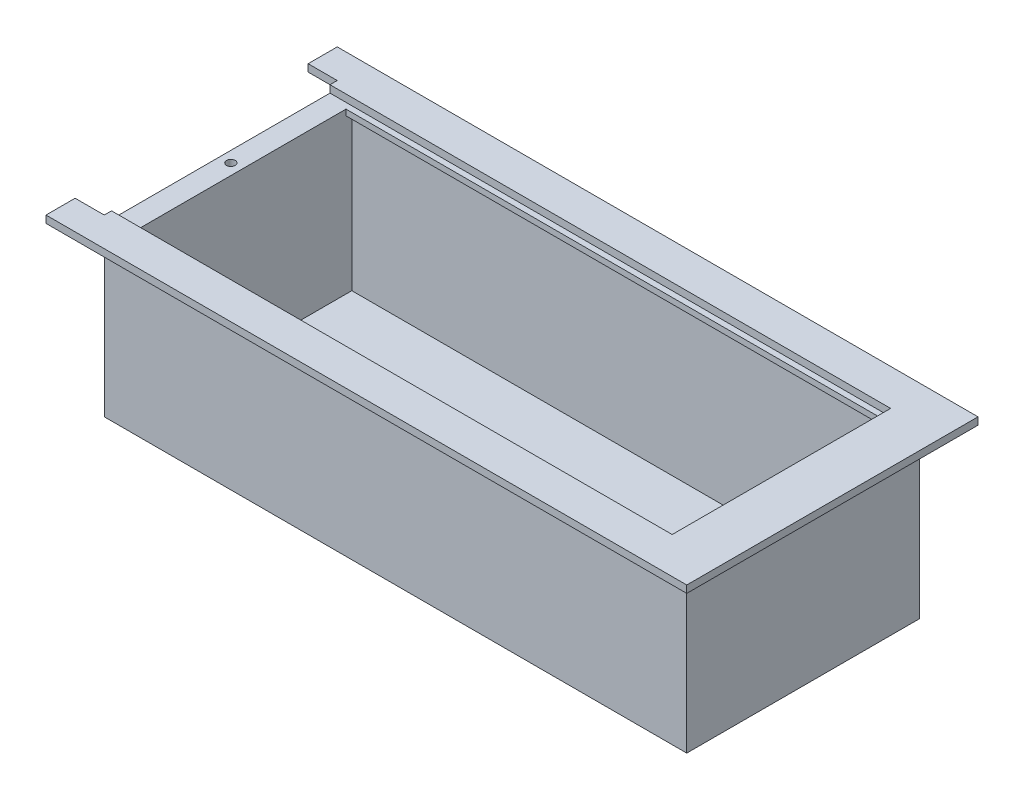
ISO-10303-21;
HEADER;
FILE_DESCRIPTION(('STEP AP214'),'2;1');
FILE_NAME('part.step','',(''),(''),'','','');
FILE_SCHEMA(('AUTOMOTIVE_DESIGN { 1 0 10303 214 1 1 1 1 }'));
ENDSEC;
DATA;
#1=APPLICATION_CONTEXT('core data for automotive mechanical design processes');
#2=APPLICATION_PROTOCOL_DEFINITION('international standard','automotive_design',2000,#1);
#3=PRODUCT_CONTEXT('',#1,'mechanical');
#4=PRODUCT('Part','Part','',(#3));
#5=PRODUCT_RELATED_PRODUCT_CATEGORY('part','',(#4));
#6=PRODUCT_DEFINITION_FORMATION('','',#4);
#7=PRODUCT_DEFINITION_CONTEXT('part definition',#1,'design');
#8=PRODUCT_DEFINITION('design','',#6,#7);
#9=PRODUCT_DEFINITION_SHAPE('','',#8);
#10=(LENGTH_UNIT() NAMED_UNIT(*) SI_UNIT(.MILLI.,.METRE.));
#11=(NAMED_UNIT(*) PLANE_ANGLE_UNIT() SI_UNIT($,.RADIAN.));
#12=(NAMED_UNIT(*) SI_UNIT($,.STERADIAN.) SOLID_ANGLE_UNIT());
#13=UNCERTAINTY_MEASURE_WITH_UNIT(LENGTH_MEASURE(1.E-05),#10,'distance_accuracy_value','');
#14=(GEOMETRIC_REPRESENTATION_CONTEXT(3) GLOBAL_UNCERTAINTY_ASSIGNED_CONTEXT((#13)) GLOBAL_UNIT_ASSIGNED_CONTEXT((#10,
#11,#12)) REPRESENTATION_CONTEXT('',''));
#15=CARTESIAN_POINT('',(0.,0.,0.));
#16=DIRECTION('',(0.,0.,1.));
#17=DIRECTION('',(1.,0.,0.));
#18=AXIS2_PLACEMENT_3D('',#15,#16,#17);
#19=CARTESIAN_POINT('',(7.49999999999995,2.50000000000005,77.5));
#20=DIRECTION('',(-1.,0.,0.));
#21=DIRECTION('',(0.,0.,1.));
#22=AXIS2_PLACEMENT_3D('',#19,#20,#21);
#23=PLANE('',#22);
#24=DIRECTION('',(0.,0.,-1.));
#25=VECTOR('',#24,1.);
#26=CARTESIAN_POINT('',(7.49999999999995,55.5,4.50000000000005));
#27=LINE('',#26,#25);
#28=CARTESIAN_POINT('',(7.49999999999995,55.5,4.50000000000005));
#29=VERTEX_POINT('',#28);
#30=CARTESIAN_POINT('',(7.49999999999995,55.5,2.50000000000005));
#31=VERTEX_POINT('',#30);
#32=EDGE_CURVE('E317',#29,#31,#27,.T.);
#33=ORIENTED_EDGE('',*,*,#32,.F.);
#34=DIRECTION('',(0.,-1.,0.));
#35=VECTOR('',#34,1.);
#36=CARTESIAN_POINT('',(7.49999999999995,57.5,4.50000000000005));
#37=LINE('',#36,#35);
#38=CARTESIAN_POINT('',(7.49999999999995,57.5,4.50000000000005));
#39=VERTEX_POINT('',#38);
#40=EDGE_CURVE('E301',#39,#29,#37,.T.);
#41=ORIENTED_EDGE('',*,*,#40,.F.);
#42=DIRECTION('',(0.,0.,-1.));
#43=VECTOR('',#42,1.);
#44=CARTESIAN_POINT('',(7.49999999999995,57.5,77.5));
#45=LINE('',#44,#43);
#46=CARTESIAN_POINT('',(7.49999999999995,57.5,75.5));
#47=VERTEX_POINT('',#46);
#48=EDGE_CURVE('E397',#47,#39,#45,.T.);
#49=ORIENTED_EDGE('',*,*,#48,.F.);
#50=DIRECTION('',(0.,1.,0.));
#51=VECTOR('',#50,1.);
#52=CARTESIAN_POINT('',(7.49999999999995,57.5,75.5));
#53=LINE('',#52,#51);
#54=CARTESIAN_POINT('',(7.49999999999995,55.5,75.5));
#55=VERTEX_POINT('',#54);
#56=EDGE_CURVE('E320',#55,#47,#53,.T.);
#57=ORIENTED_EDGE('',*,*,#56,.F.);
#58=DIRECTION('',(0.,0.,1.));
#59=VECTOR('',#58,1.);
#60=CARTESIAN_POINT('',(7.49999999999995,55.5,75.5));
#61=LINE('',#60,#59);
#62=CARTESIAN_POINT('',(7.49999999999995,55.5,77.5));
#63=VERTEX_POINT('',#62);
#64=EDGE_CURVE('E328',#55,#63,#61,.T.);
#65=ORIENTED_EDGE('',*,*,#64,.T.);
#66=DIRECTION('',(0.,1.,0.));
#67=VECTOR('',#66,1.);
#68=CARTESIAN_POINT('',(7.49999999999995,2.50000000000005,77.5));
#69=LINE('',#68,#67);
#70=CARTESIAN_POINT('',(7.49999999999995,2.50000000000005,77.5));
#71=VERTEX_POINT('',#70);
#72=EDGE_CURVE('E439',#71,#63,#69,.T.);
#73=ORIENTED_EDGE('',*,*,#72,.F.);
#74=DIRECTION('',(0.,0.,1.));
#75=VECTOR('',#74,1.);
#76=CARTESIAN_POINT('',(7.49999999999995,2.50000000000005,77.5));
#77=LINE('',#76,#75);
#78=CARTESIAN_POINT('',(7.49999999999995,2.50000000000005,2.50000000000005));
#79=VERTEX_POINT('',#78);
#80=EDGE_CURVE('E421',#79,#71,#77,.T.);
#81=ORIENTED_EDGE('',*,*,#80,.F.);
#82=DIRECTION('',(0.,1.,0.));
#83=VECTOR('',#82,1.);
#84=CARTESIAN_POINT('',(7.49999999999995,2.50000000000005,2.50000000000005));
#85=LINE('',#84,#83);
#86=EDGE_CURVE('E442',#79,#31,#85,.T.);
#87=ORIENTED_EDGE('',*,*,#86,.T.);
#88=EDGE_LOOP('',(#33,#41,#49,#57,#65,#73,#81,#87));
#89=FACE_BOUND('',#88,.T.);
#90=ADVANCED_FACE('F33',(#89),#23,.F.);
#91=CARTESIAN_POINT('',(192.5,2.50000000000005,77.5));
#92=DIRECTION('',(1.,0.,0.));
#93=DIRECTION('',(0.,0.,-1.));
#94=AXIS2_PLACEMENT_3D('',#91,#92,#93);
#95=PLANE('',#94);
#96=DIRECTION('',(0.,0.,1.));
#97=VECTOR('',#96,1.);
#98=CARTESIAN_POINT('',(192.5,55.,12.5000000000001));
#99=LINE('',#98,#97);
#100=CARTESIAN_POINT('',(192.5,55.,12.5000000000001));
#101=VERTEX_POINT('',#100);
#102=CARTESIAN_POINT('',(192.5,55.,67.5));
#103=VERTEX_POINT('',#102);
#104=EDGE_CURVE('E284',#101,#103,#99,.T.);
#105=ORIENTED_EDGE('',*,*,#104,.F.);
#106=DIRECTION('',(0.,-1.,0.));
#107=VECTOR('',#106,1.);
#108=CARTESIAN_POINT('',(192.5,57.5,12.5000000000001));
#109=LINE('',#108,#107);
#110=CARTESIAN_POINT('',(192.5,57.5,12.5000000000001));
#111=VERTEX_POINT('',#110);
#112=EDGE_CURVE('E267',#111,#101,#109,.T.);
#113=ORIENTED_EDGE('',*,*,#112,.F.);
#114=DIRECTION('',(0.,0.,-1.));
#115=VECTOR('',#114,1.);
#116=CARTESIAN_POINT('',(192.5,57.5,12.5000000000001));
#117=LINE('',#116,#115);
#118=CARTESIAN_POINT('',(192.5,57.5,67.5));
#119=VERTEX_POINT('',#118);
#120=EDGE_CURVE('E273',#119,#111,#117,.T.);
#121=ORIENTED_EDGE('',*,*,#120,.F.);
#122=DIRECTION('',(0.,1.,0.));
#123=VECTOR('',#122,1.);
#124=CARTESIAN_POINT('',(192.5,57.5,67.5));
#125=LINE('',#124,#123);
#126=EDGE_CURVE('E287',#103,#119,#125,.T.);
#127=ORIENTED_EDGE('',*,*,#126,.F.);
#128=EDGE_LOOP('',(#105,#113,#121,#127));
#129=FACE_BOUND('',#128,.T.);
#130=DIRECTION('',(0.,0.,-1.));
#131=VECTOR('',#130,1.);
#132=CARTESIAN_POINT('',(192.5,55.5,4.50000000000005));
#133=LINE('',#132,#131);
#134=CARTESIAN_POINT('',(192.5,55.5,4.50000000000005));
#135=VERTEX_POINT('',#134);
#136=CARTESIAN_POINT('',(192.5,55.5,2.50000000000005));
#137=VERTEX_POINT('',#136);
#138=EDGE_CURVE('E314',#135,#137,#133,.T.);
#139=ORIENTED_EDGE('',*,*,#138,.T.);
#140=DIRECTION('',(0.,1.,0.));
#141=VECTOR('',#140,1.);
#142=CARTESIAN_POINT('',(192.5,2.50000000000005,2.50000000000003));
#143=LINE('',#142,#141);
#144=CARTESIAN_POINT('',(192.5,2.50000000000005,2.50000000000003));
#145=VERTEX_POINT('',#144);
#146=EDGE_CURVE('E445',#145,#137,#143,.T.);
#147=ORIENTED_EDGE('',*,*,#146,.F.);
#148=DIRECTION('',(0.,0.,-1.));
#149=VECTOR('',#148,1.);
#150=CARTESIAN_POINT('',(192.5,2.50000000000005,77.5));
#151=LINE('',#150,#149);
#152=CARTESIAN_POINT('',(192.5,2.50000000000005,77.5));
#153=VERTEX_POINT('',#152);
#154=EDGE_CURVE('E414',#153,#145,#151,.T.);
#155=ORIENTED_EDGE('',*,*,#154,.F.);
#156=DIRECTION('',(0.,1.,0.));
#157=VECTOR('',#156,1.);
#158=CARTESIAN_POINT('',(192.5,2.50000000000005,77.5));
#159=LINE('',#158,#157);
#160=CARTESIAN_POINT('',(192.5,55.5,77.5));
#161=VERTEX_POINT('',#160);
#162=EDGE_CURVE('E434',#153,#161,#159,.T.);
#163=ORIENTED_EDGE('',*,*,#162,.T.);
#164=DIRECTION('',(0.,0.,1.));
#165=VECTOR('',#164,1.);
#166=CARTESIAN_POINT('',(192.5,55.5,75.5));
#167=LINE('',#166,#165);
#168=CARTESIAN_POINT('',(192.5,55.5,75.5));
#169=VERTEX_POINT('',#168);
#170=EDGE_CURVE('E332',#169,#161,#167,.T.);
#171=ORIENTED_EDGE('',*,*,#170,.F.);
#172=DIRECTION('',(0.,-1.,0.));
#173=VECTOR('',#172,1.);
#174=CARTESIAN_POINT('',(192.5,57.5,75.5));
#175=LINE('',#174,#173);
#176=CARTESIAN_POINT('',(192.5,57.5,75.5));
#177=VERTEX_POINT('',#176);
#178=EDGE_CURVE('E324',#177,#169,#175,.T.);
#179=ORIENTED_EDGE('',*,*,#178,.F.);
#180=DIRECTION('',(0.,0.,1.));
#181=VECTOR('',#180,1.);
#182=CARTESIAN_POINT('',(192.5,57.5,75.5));
#183=LINE('',#182,#181);
#184=CARTESIAN_POINT('',(192.5,57.5,77.5));
#185=VERTEX_POINT('',#184);
#186=EDGE_CURVE('E334',#177,#185,#183,.T.);
#187=ORIENTED_EDGE('',*,*,#186,.T.);
#188=CARTESIAN_POINT('',(192.5,60.0000000000001,77.5));
#189=VERTEX_POINT('',#188);
#190=EDGE_CURVE('E438',#185,#189,#159,.T.);
#191=ORIENTED_EDGE('',*,*,#190,.T.);
#192=DIRECTION('',(0.,0.,-1.));
#193=VECTOR('',#192,1.);
#194=CARTESIAN_POINT('',(192.5,60.0000000000001,77.5));
#195=LINE('',#194,#193);
#196=CARTESIAN_POINT('',(192.5,60.0000000000001,2.50000000000003));
#197=VERTEX_POINT('',#196);
#198=EDGE_CURVE('E411',#189,#197,#195,.T.);
#199=ORIENTED_EDGE('',*,*,#198,.T.);
#200=CARTESIAN_POINT('',(192.5,57.5,2.50000000000005));
#201=VERTEX_POINT('',#200);
#202=EDGE_CURVE('E427',#201,#197,#143,.T.);
#203=ORIENTED_EDGE('',*,*,#202,.F.);
#204=DIRECTION('',(0.,0.,-1.));
#205=VECTOR('',#204,1.);
#206=CARTESIAN_POINT('',(192.5,57.5,4.50000000000005));
#207=LINE('',#206,#205);
#208=CARTESIAN_POINT('',(192.5,57.5,4.50000000000005));
#209=VERTEX_POINT('',#208);
#210=EDGE_CURVE('E310',#209,#201,#207,.T.);
#211=ORIENTED_EDGE('',*,*,#210,.F.);
#212=DIRECTION('',(0.,1.,0.));
#213=VECTOR('',#212,1.);
#214=CARTESIAN_POINT('',(192.5,57.5,4.50000000000005));
#215=LINE('',#214,#213);
#216=EDGE_CURVE('E306',#135,#209,#215,.T.);
#217=ORIENTED_EDGE('',*,*,#216,.F.);
#218=EDGE_LOOP('',(#139,#147,#155,#163,#171,#179,#187,#191,#199,#203,#211,#217));
#219=FACE_BOUND('',#218,.T.);
#220=ADVANCED_FACE('F538',(#129,#219),#95,.F.);
#221=CARTESIAN_POINT('',(192.5,2.50000000000005,2.50000000000003));
#222=DIRECTION('',(0.,0.,-1.));
#223=DIRECTION('',(-1.,0.,0.));
#224=AXIS2_PLACEMENT_3D('',#221,#222,#223);
#225=PLANE('',#224);
#226=DIRECTION('',(1.,0.,0.));
#227=VECTOR('',#226,1.);
#228=CARTESIAN_POINT('',(7.49999999999995,55.5,2.50000000000005));
#229=LINE('',#228,#227);
#230=EDGE_CURVE('E294',#31,#137,#229,.T.);
#231=ORIENTED_EDGE('',*,*,#230,.F.);
#232=ORIENTED_EDGE('',*,*,#86,.F.);
#233=DIRECTION('',(-1.,0.,0.));
#234=VECTOR('',#233,1.);
#235=CARTESIAN_POINT('',(192.5,2.50000000000005,2.50000000000003));
#236=LINE('',#235,#234);
#237=EDGE_CURVE('E417',#145,#79,#236,.T.);
#238=ORIENTED_EDGE('',*,*,#237,.F.);
#239=ORIENTED_EDGE('',*,*,#146,.T.);
#240=EDGE_LOOP('',(#231,#232,#238,#239));
#241=FACE_BOUND('',#240,.T.);
#242=ADVANCED_FACE('F544',(#241),#225,.F.);
#243=DIRECTION('',(-1.,0.,0.));
#244=VECTOR('',#243,1.);
#245=CARTESIAN_POINT('',(7.49999999999995,57.5,2.50000000000004));
#246=LINE('',#245,#244);
#247=CARTESIAN_POINT('',(0.,57.5,2.50000000000004));
#248=VERTEX_POINT('',#247);
#249=EDGE_CURVE('E400',#201,#248,#246,.T.);
#250=ORIENTED_EDGE('',*,*,#249,.F.);
#251=ORIENTED_EDGE('',*,*,#202,.T.);
#252=DIRECTION('',(-1.,0.,0.));
#253=VECTOR('',#252,1.);
#254=CARTESIAN_POINT('',(192.5,60.0000000000001,2.50000000000003));
#255=LINE('',#254,#253);
#256=CARTESIAN_POINT('',(0.,60.0000000000001,2.50000000000004));
#257=VERTEX_POINT('',#256);
#258=EDGE_CURVE('E430',#197,#257,#255,.T.);
#259=ORIENTED_EDGE('',*,*,#258,.T.);
#260=DIRECTION('',(0.,1.,0.));
#261=VECTOR('',#260,1.);
#262=CARTESIAN_POINT('',(0.,57.5,2.50000000000004));
#263=LINE('',#262,#261);
#264=EDGE_CURVE('E407',#248,#257,#263,.T.);
#265=ORIENTED_EDGE('',*,*,#264,.F.);
#266=EDGE_LOOP('',(#250,#251,#259,#265));
#267=FACE_BOUND('',#266,.T.);
#268=ADVANCED_FACE('F551',(#267),#225,.F.);
#269=CARTESIAN_POINT('',(192.5,2.50000000000005,77.5));
#270=DIRECTION('',(0.,0.,1.));
#271=DIRECTION('',(1.,0.,0.));
#272=AXIS2_PLACEMENT_3D('',#269,#270,#271);
#273=PLANE('',#272);
#274=ORIENTED_EDGE('',*,*,#190,.F.);
#275=DIRECTION('',(1.,0.,0.));
#276=VECTOR('',#275,1.);
#277=CARTESIAN_POINT('',(7.49999999999995,57.5,77.5));
#278=LINE('',#277,#276);
#279=CARTESIAN_POINT('',(0.,57.5,77.5));
#280=VERTEX_POINT('',#279);
#281=EDGE_CURVE('E405',#280,#185,#278,.T.);
#282=ORIENTED_EDGE('',*,*,#281,.F.);
#283=DIRECTION('',(0.,1.,0.));
#284=VECTOR('',#283,1.);
#285=CARTESIAN_POINT('',(0.,57.5,77.5));
#286=LINE('',#285,#284);
#287=CARTESIAN_POINT('',(0.,60.0000000000001,77.5));
#288=VERTEX_POINT('',#287);
#289=EDGE_CURVE('E408',#280,#288,#286,.T.);
#290=ORIENTED_EDGE('',*,*,#289,.T.);
#291=DIRECTION('',(1.,0.,0.));
#292=VECTOR('',#291,1.);
#293=CARTESIAN_POINT('',(192.5,60.0000000000001,77.5));
#294=LINE('',#293,#292);
#295=EDGE_CURVE('E418',#288,#189,#294,.T.);
#296=ORIENTED_EDGE('',*,*,#295,.T.);
#297=EDGE_LOOP('',(#274,#282,#290,#296));
#298=FACE_BOUND('',#297,.T.);
#299=ADVANCED_FACE('F533',(#298),#273,.F.);
#300=DIRECTION('',(-1.,0.,0.));
#301=VECTOR('',#300,1.);
#302=CARTESIAN_POINT('',(7.49999999999995,55.5,77.5));
#303=LINE('',#302,#301);
#304=EDGE_CURVE('E319',#161,#63,#303,.T.);
#305=ORIENTED_EDGE('',*,*,#304,.F.);
#306=ORIENTED_EDGE('',*,*,#162,.F.);
#307=DIRECTION('',(1.,0.,0.));
#308=VECTOR('',#307,1.);
#309=CARTESIAN_POINT('',(192.5,2.50000000000005,77.5));
#310=LINE('',#309,#308);
#311=EDGE_CURVE('E424',#71,#153,#310,.T.);
#312=ORIENTED_EDGE('',*,*,#311,.F.);
#313=ORIENTED_EDGE('',*,*,#72,.T.);
#314=EDGE_LOOP('',(#305,#306,#312,#313));
#315=FACE_BOUND('',#314,.T.);
#316=ADVANCED_FACE('F526',(#315),#273,.F.);
#317=CARTESIAN_POINT('',(200.,0.,80.));
#318=DIRECTION('',(-1.,0.,0.));
#319=DIRECTION('',(0.,0.,1.));
#320=AXIS2_PLACEMENT_3D('',#317,#318,#319);
#321=PLANE('',#320);
#322=DIRECTION('',(0.,0.,-1.));
#323=VECTOR('',#322,1.);
#324=CARTESIAN_POINT('',(200.,57.5,90.));
#325=LINE('',#324,#323);
#326=CARTESIAN_POINT('',(200.,57.5,80.));
#327=VERTEX_POINT('',#326);
#328=CARTESIAN_POINT('',(200.,57.5,0.));
#329=VERTEX_POINT('',#328);
#330=EDGE_CURVE('E11',#327,#329,#325,.T.);
#331=ORIENTED_EDGE('',*,*,#330,.F.);
#332=DIRECTION('',(0.,1.,0.));
#333=VECTOR('',#332,1.);
#334=CARTESIAN_POINT('',(200.,0.,80.));
#335=LINE('',#334,#333);
#336=CARTESIAN_POINT('',(200.,0.,80.));
#337=VERTEX_POINT('',#336);
#338=EDGE_CURVE('E454',#337,#327,#335,.T.);
#339=ORIENTED_EDGE('',*,*,#338,.F.);
#340=DIRECTION('',(0.,0.,-1.));
#341=VECTOR('',#340,1.);
#342=CARTESIAN_POINT('',(200.,0.,80.));
#343=LINE('',#342,#341);
#344=CARTESIAN_POINT('',(200.,0.,0.));
#345=VERTEX_POINT('',#344);
#346=EDGE_CURVE('E467',#337,#345,#343,.T.);
#347=ORIENTED_EDGE('',*,*,#346,.T.);
#348=DIRECTION('',(0.,1.,0.));
#349=VECTOR('',#348,1.);
#350=CARTESIAN_POINT('',(200.,0.,0.));
#351=LINE('',#350,#349);
#352=EDGE_CURVE('E462',#345,#329,#351,.T.);
#353=ORIENTED_EDGE('',*,*,#352,.T.);
#354=EDGE_LOOP('',(#331,#339,#347,#353));
#355=FACE_BOUND('',#354,.T.);
#356=ADVANCED_FACE('F524',(#355),#321,.F.);
#357=CARTESIAN_POINT('',(0.,0.,80.));
#358=DIRECTION('',(0.,0.,-1.));
#359=DIRECTION('',(-1.,0.,0.));
#360=AXIS2_PLACEMENT_3D('',#357,#358,#359);
#361=PLANE('',#360);
#362=DIRECTION('',(1.,0.,0.));
#363=VECTOR('',#362,1.);
#364=CARTESIAN_POINT('',(-10.,57.5,80.));
#365=LINE('',#364,#363);
#366=CARTESIAN_POINT('',(0.,57.5,80.));
#367=VERTEX_POINT('',#366);
#368=EDGE_CURVE('E42',#367,#327,#365,.T.);
#369=ORIENTED_EDGE('',*,*,#368,.F.);
#370=DIRECTION('',(0.,-1.,0.));
#371=VECTOR('',#370,1.);
#372=CARTESIAN_POINT('',(0.,0.,80.));
#373=LINE('',#372,#371);
#374=CARTESIAN_POINT('',(0.,0.,80.));
#375=VERTEX_POINT('',#374);
#376=EDGE_CURVE('E452',#367,#375,#373,.T.);
#377=ORIENTED_EDGE('',*,*,#376,.T.);
#378=DIRECTION('',(1.,0.,0.));
#379=VECTOR('',#378,1.);
#380=CARTESIAN_POINT('',(0.,0.,80.));
#381=LINE('',#380,#379);
#382=EDGE_CURVE('E451',#375,#337,#381,.T.);
#383=ORIENTED_EDGE('',*,*,#382,.T.);
#384=ORIENTED_EDGE('',*,*,#338,.T.);
#385=EDGE_LOOP('',(#369,#377,#383,#384));
#386=FACE_BOUND('',#385,.T.);
#387=ADVANCED_FACE('F483',(#386),#361,.F.);
#388=CARTESIAN_POINT('',(0.,0.,80.));
#389=DIRECTION('',(1.,0.,0.));
#390=DIRECTION('',(0.,0.,-1.));
#391=AXIS2_PLACEMENT_3D('',#388,#389,#390);
#392=PLANE('',#391);
#393=DIRECTION('',(0.,0.,-1.));
#394=VECTOR('',#393,1.);
#395=CARTESIAN_POINT('',(0.,60.0000000000001,80.));
#396=LINE('',#395,#394);
#397=CARTESIAN_POINT('',(0.,60.0000000000001,80.));
#398=VERTEX_POINT('',#397);
#399=EDGE_CURVE('E465',#398,#288,#396,.T.);
#400=ORIENTED_EDGE('',*,*,#399,.T.);
#401=ORIENTED_EDGE('',*,*,#289,.F.);
#402=DIRECTION('',(0.,0.,1.));
#403=VECTOR('',#402,1.);
#404=CARTESIAN_POINT('',(0.,57.5,77.5));
#405=LINE('',#404,#403);
#406=EDGE_CURVE('E403',#248,#280,#405,.T.);
#407=ORIENTED_EDGE('',*,*,#406,.F.);
#408=ORIENTED_EDGE('',*,*,#264,.T.);
#409=CARTESIAN_POINT('',(0.,60.0000000000001,0.));
#410=VERTEX_POINT('',#409);
#411=EDGE_CURVE('E457',#257,#410,#396,.T.);
#412=ORIENTED_EDGE('',*,*,#411,.T.);
#413=DIRECTION('',(0.,-1.,0.));
#414=VECTOR('',#413,1.);
#415=CARTESIAN_POINT('',(0.,0.,0.));
#416=LINE('',#415,#414);
#417=CARTESIAN_POINT('',(0.,57.5,0.));
#418=VERTEX_POINT('',#417);
#419=EDGE_CURVE('E458',#410,#418,#416,.T.);
#420=ORIENTED_EDGE('',*,*,#419,.T.);
#421=CARTESIAN_POINT('',(0.,0.,0.));
#422=VERTEX_POINT('',#421);
#423=EDGE_CURVE('E437',#418,#422,#416,.T.);
#424=ORIENTED_EDGE('',*,*,#423,.T.);
#425=DIRECTION('',(0.,0.,-1.));
#426=VECTOR('',#425,1.);
#427=CARTESIAN_POINT('',(0.,0.,80.));
#428=LINE('',#427,#426);
#429=EDGE_CURVE('E37',#375,#422,#428,.T.);
#430=ORIENTED_EDGE('',*,*,#429,.F.);
#431=ORIENTED_EDGE('',*,*,#376,.F.);
#432=EDGE_CURVE('E448',#398,#367,#373,.T.);
#433=ORIENTED_EDGE('',*,*,#432,.F.);
#434=EDGE_LOOP('',(#400,#401,#407,#408,#412,#420,#424,#430,#431,#433));
#435=FACE_BOUND('',#434,.T.);
#436=ADVANCED_FACE('F35',(#435),#392,.F.);
#437=CARTESIAN_POINT('',(0.,0.,80.));
#438=DIRECTION('',(0.,1.,0.));
#439=DIRECTION('',(0.,0.,1.));
#440=AXIS2_PLACEMENT_3D('',#437,#438,#439);
#441=PLANE('',#440);
#442=DIRECTION('',(-1.,0.,0.));
#443=VECTOR('',#442,1.);
#444=CARTESIAN_POINT('',(42.5,0.,47.5));
#445=LINE('',#444,#443);
#446=CARTESIAN_POINT('',(42.5,0.,47.5));
#447=VERTEX_POINT('',#446);
#448=CARTESIAN_POINT('',(17.5,0.,47.5));
#449=VERTEX_POINT('',#448);
#450=EDGE_CURVE('E565',#447,#449,#445,.T.);
#451=ORIENTED_EDGE('',*,*,#450,.F.);
#452=DIRECTION('',(0.,0.,1.));
#453=VECTOR('',#452,1.);
#454=CARTESIAN_POINT('',(42.5,0.,47.5));
#455=LINE('',#454,#453);
#456=CARTESIAN_POINT('',(42.5,0.,32.5));
#457=VERTEX_POINT('',#456);
#458=EDGE_CURVE('E268',#457,#447,#455,.T.);
#459=ORIENTED_EDGE('',*,*,#458,.F.);
#460=DIRECTION('',(1.,0.,0.));
#461=VECTOR('',#460,1.);
#462=CARTESIAN_POINT('',(42.5,0.,32.5));
#463=LINE('',#462,#461);
#464=CARTESIAN_POINT('',(17.5,0.,32.5));
#465=VERTEX_POINT('',#464);
#466=EDGE_CURVE('E265',#465,#457,#463,.T.);
#467=ORIENTED_EDGE('',*,*,#466,.F.);
#468=DIRECTION('',(0.,0.,-1.));
#469=VECTOR('',#468,1.);
#470=CARTESIAN_POINT('',(17.5,0.,47.5));
#471=LINE('',#470,#469);
#472=EDGE_CURVE('E243',#449,#465,#471,.T.);
#473=ORIENTED_EDGE('',*,*,#472,.F.);
#474=EDGE_LOOP('',(#451,#459,#467,#473));
#475=FACE_BOUND('',#474,.T.);
#476=DIRECTION('',(1.,0.,0.));
#477=VECTOR('',#476,1.);
#478=CARTESIAN_POINT('',(0.,0.,0.));
#479=LINE('',#478,#477);
#480=EDGE_CURVE('E460',#422,#345,#479,.T.);
#481=ORIENTED_EDGE('',*,*,#480,.T.);
#482=ORIENTED_EDGE('',*,*,#346,.F.);
#483=ORIENTED_EDGE('',*,*,#382,.F.);
#484=ORIENTED_EDGE('',*,*,#429,.T.);
#485=EDGE_LOOP('',(#481,#482,#483,#484));
#486=FACE_BOUND('',#485,.T.);
#487=ADVANCED_FACE('F523',(#475,#486),#441,.F.);
#488=CARTESIAN_POINT('',(0.,60.0000000000001,80.));
#489=DIRECTION('',(0.,-1.,0.));
#490=DIRECTION('',(0.,0.,-1.));
#491=AXIS2_PLACEMENT_3D('',#488,#489,#490);
#492=PLANE('',#491);
#493=ORIENTED_EDGE('',*,*,#295,.F.);
#494=ORIENTED_EDGE('',*,*,#399,.F.);
#495=DIRECTION('',(-1.,0.,0.));
#496=VECTOR('',#495,1.);
#497=CARTESIAN_POINT('',(-10.,60.0000000000001,80.));
#498=LINE('',#497,#496);
#499=CARTESIAN_POINT('',(-10.,60.0000000000001,80.));
#500=VERTEX_POINT('',#499);
#501=EDGE_CURVE('E360',#398,#500,#498,.T.);
#502=ORIENTED_EDGE('',*,*,#501,.T.);
#503=DIRECTION('',(0.,0.,-1.));
#504=VECTOR('',#503,1.);
#505=CARTESIAN_POINT('',(-10.,60.0000000000001,90.));
#506=LINE('',#505,#504);
#507=CARTESIAN_POINT('',(-10.,60.0000000000001,90.));
#508=VERTEX_POINT('',#507);
#509=EDGE_CURVE('E364',#508,#500,#506,.T.);
#510=ORIENTED_EDGE('',*,*,#509,.F.);
#511=DIRECTION('',(-1.,0.,0.));
#512=VECTOR('',#511,1.);
#513=CARTESIAN_POINT('',(-10.,60.0000000000001,90.));
#514=LINE('',#513,#512);
#515=CARTESIAN_POINT('',(210.,60.0000000000001,90.));
#516=VERTEX_POINT('',#515);
#517=EDGE_CURVE('E362',#516,#508,#514,.T.);
#518=ORIENTED_EDGE('',*,*,#517,.F.);
#519=DIRECTION('',(0.,0.,1.));
#520=VECTOR('',#519,1.);
#521=CARTESIAN_POINT('',(210.,60.0000000000001,90.));
#522=LINE('',#521,#520);
#523=CARTESIAN_POINT('',(210.,60.0000000000001,-10.));
#524=VERTEX_POINT('',#523);
#525=EDGE_CURVE('E352',#524,#516,#522,.T.);
#526=ORIENTED_EDGE('',*,*,#525,.F.);
#527=DIRECTION('',(1.,0.,0.));
#528=VECTOR('',#527,1.);
#529=CARTESIAN_POINT('',(200.,60.0000000000001,-10.));
#530=LINE('',#529,#528);
#531=CARTESIAN_POINT('',(-10.,60.0000000000001,-10.));
#532=VERTEX_POINT('',#531);
#533=EDGE_CURVE('E382',#532,#524,#530,.T.);
#534=ORIENTED_EDGE('',*,*,#533,.F.);
#535=DIRECTION('',(0.,0.,1.));
#536=VECTOR('',#535,1.);
#537=CARTESIAN_POINT('',(-10.,60.0000000000001,-10.));
#538=LINE('',#537,#536);
#539=CARTESIAN_POINT('',(-10.,60.0000000000001,0.));
#540=VERTEX_POINT('',#539);
#541=EDGE_CURVE('E384',#532,#540,#538,.T.);
#542=ORIENTED_EDGE('',*,*,#541,.T.);
#543=DIRECTION('',(1.,0.,0.));
#544=VECTOR('',#543,1.);
#545=CARTESIAN_POINT('',(200.,60.0000000000001,0.));
#546=LINE('',#545,#544);
#547=EDGE_CURVE('E380',#540,#410,#546,.T.);
#548=ORIENTED_EDGE('',*,*,#547,.T.);
#549=ORIENTED_EDGE('',*,*,#411,.F.);
#550=ORIENTED_EDGE('',*,*,#258,.F.);
#551=ORIENTED_EDGE('',*,*,#198,.F.);
#552=EDGE_LOOP('',(#493,#494,#502,#510,#518,#526,#534,#542,#548,#549,#550,#551));
#553=FACE_BOUND('',#552,.T.);
#554=ADVANCED_FACE('F492',(#553),#492,.F.);
#555=CARTESIAN_POINT('',(0.,0.,0.));
#556=DIRECTION('',(0.,0.,-1.));
#557=DIRECTION('',(-1.,0.,0.));
#558=AXIS2_PLACEMENT_3D('',#555,#556,#557);
#559=PLANE('',#558);
#560=DIRECTION('',(-1.,0.,0.));
#561=VECTOR('',#560,1.);
#562=CARTESIAN_POINT('',(200.,57.5,0.));
#563=LINE('',#562,#561);
#564=EDGE_CURVE('E385',#329,#418,#563,.T.);
#565=ORIENTED_EDGE('',*,*,#564,.F.);
#566=ORIENTED_EDGE('',*,*,#352,.F.);
#567=ORIENTED_EDGE('',*,*,#480,.F.);
#568=ORIENTED_EDGE('',*,*,#423,.F.);
#569=EDGE_LOOP('',(#565,#566,#567,#568));
#570=FACE_BOUND('',#569,.T.);
#571=ADVANCED_FACE('F522',(#570),#559,.T.);
#572=CARTESIAN_POINT('',(0.,2.50000000000005,0.));
#573=DIRECTION('',(0.,1.,0.));
#574=DIRECTION('',(0.,0.,1.));
#575=AXIS2_PLACEMENT_3D('',#572,#573,#574);
#576=PLANE('',#575);
#577=DIRECTION('',(0.,0.,-1.));
#578=VECTOR('',#577,1.);
#579=CARTESIAN_POINT('',(42.5,2.50000000000005,47.5));
#580=LINE('',#579,#578);
#581=CARTESIAN_POINT('',(42.5,2.50000000000005,47.5));
#582=VERTEX_POINT('',#581);
#583=CARTESIAN_POINT('',(42.5,2.50000000000005,32.5));
#584=VERTEX_POINT('',#583);
#585=EDGE_CURVE('E58',#582,#584,#580,.T.);
#586=ORIENTED_EDGE('',*,*,#585,.F.);
#587=DIRECTION('',(1.,0.,0.));
#588=VECTOR('',#587,1.);
#589=CARTESIAN_POINT('',(42.5,2.50000000000005,47.5));
#590=LINE('',#589,#588);
#591=CARTESIAN_POINT('',(17.5,2.50000000000005,47.5));
#592=VERTEX_POINT('',#591);
#593=EDGE_CURVE('E256',#592,#582,#590,.T.);
#594=ORIENTED_EDGE('',*,*,#593,.F.);
#595=DIRECTION('',(0.,0.,1.));
#596=VECTOR('',#595,1.);
#597=CARTESIAN_POINT('',(17.5,2.50000000000005,47.5));
#598=LINE('',#597,#596);
#599=CARTESIAN_POINT('',(17.5,2.50000000000005,32.5));
#600=VERTEX_POINT('',#599);
#601=EDGE_CURVE('E240',#600,#592,#598,.T.);
#602=ORIENTED_EDGE('',*,*,#601,.F.);
#603=DIRECTION('',(-1.,0.,0.));
#604=VECTOR('',#603,1.);
#605=CARTESIAN_POINT('',(42.5,2.50000000000005,32.5));
#606=LINE('',#605,#604);
#607=EDGE_CURVE('E249',#584,#600,#606,.T.);
#608=ORIENTED_EDGE('',*,*,#607,.F.);
#609=EDGE_LOOP('',(#586,#594,#602,#608));
#610=FACE_BOUND('',#609,.T.);
#611=ORIENTED_EDGE('',*,*,#154,.T.);
#612=ORIENTED_EDGE('',*,*,#237,.T.);
#613=ORIENTED_EDGE('',*,*,#80,.T.);
#614=ORIENTED_EDGE('',*,*,#311,.T.);
#615=EDGE_LOOP('',(#611,#612,#613,#614));
#616=FACE_BOUND('',#615,.T.);
#617=ADVANCED_FACE('F253',(#610,#616),#576,.T.);
#618=CARTESIAN_POINT('',(0.,57.5,0.));
#619=DIRECTION('',(0.,1.,0.));
#620=DIRECTION('',(0.,0.,1.));
#621=AXIS2_PLACEMENT_3D('',#618,#619,#620);
#622=PLANE('',#621);
#623=CARTESIAN_POINT('',(3.74999999999998,57.5,40.2652980210047));
#624=DIRECTION('',(0.,1.,0.));
#625=DIRECTION('',(0.,0.,1.));
#626=AXIS2_PLACEMENT_3D('',#623,#624,#625);
#627=CIRCLE('',#626,1.5);
#628=CARTESIAN_POINT('',(3.74999999999998,57.5,41.7652980210047));
#629=VERTEX_POINT('',#628);
#630=EDGE_CURVE('E337',#629,#629,#627,.T.);
#631=ORIENTED_EDGE('',*,*,#630,.F.);
#632=EDGE_LOOP('',(#631));
#633=FACE_BOUND('',#632,.T.);
#634=ORIENTED_EDGE('',*,*,#281,.T.);
#635=ORIENTED_EDGE('',*,*,#186,.F.);
#636=DIRECTION('',(1.,0.,0.));
#637=VECTOR('',#636,1.);
#638=CARTESIAN_POINT('',(7.49999999999995,57.5,75.5));
#639=LINE('',#638,#637);
#640=EDGE_CURVE('E322',#47,#177,#639,.T.);
#641=ORIENTED_EDGE('',*,*,#640,.F.);
#642=ORIENTED_EDGE('',*,*,#48,.T.);
#643=DIRECTION('',(-1.,0.,0.));
#644=VECTOR('',#643,1.);
#645=CARTESIAN_POINT('',(7.49999999999995,57.5,4.50000000000005));
#646=LINE('',#645,#644);
#647=EDGE_CURVE('E308',#209,#39,#646,.T.);
#648=ORIENTED_EDGE('',*,*,#647,.F.);
#649=ORIENTED_EDGE('',*,*,#210,.T.);
#650=ORIENTED_EDGE('',*,*,#249,.T.);
#651=ORIENTED_EDGE('',*,*,#406,.T.);
#652=EDGE_LOOP('',(#634,#635,#641,#642,#648,#649,#650,#651));
#653=FACE_BOUND('',#652,.T.);
#654=ADVANCED_FACE('F645',(#633,#653),#622,.T.);
#655=CARTESIAN_POINT('',(200.,57.5,-10.));
#656=DIRECTION('',(0.,1.,0.));
#657=DIRECTION('',(0.,0.,1.));
#658=AXIS2_PLACEMENT_3D('',#655,#656,#657);
#659=PLANE('',#658);
#660=ORIENTED_EDGE('',*,*,#564,.T.);
#661=CARTESIAN_POINT('',(-10.,57.5,0.));
#662=VERTEX_POINT('',#661);
#663=EDGE_CURVE('E376',#418,#662,#563,.T.);
#664=ORIENTED_EDGE('',*,*,#663,.T.);
#665=DIRECTION('',(0.,0.,1.));
#666=VECTOR('',#665,1.);
#667=CARTESIAN_POINT('',(-10.,57.5,-10.));
#668=LINE('',#667,#666);
#669=CARTESIAN_POINT('',(-10.,57.5,-10.));
#670=VERTEX_POINT('',#669);
#671=EDGE_CURVE('E394',#670,#662,#668,.T.);
#672=ORIENTED_EDGE('',*,*,#671,.F.);
#673=DIRECTION('',(-1.,0.,0.));
#674=VECTOR('',#673,1.);
#675=CARTESIAN_POINT('',(200.,57.5,-10.));
#676=LINE('',#675,#674);
#677=CARTESIAN_POINT('',(210.,57.5,-10.));
#678=VERTEX_POINT('',#677);
#679=EDGE_CURVE('E377',#678,#670,#676,.T.);
#680=ORIENTED_EDGE('',*,*,#679,.F.);
#681=DIRECTION('',(0.,0.,-1.));
#682=VECTOR('',#681,1.);
#683=CARTESIAN_POINT('',(210.,57.5,90.));
#684=LINE('',#683,#682);
#685=CARTESIAN_POINT('',(210.,57.5,90.));
#686=VERTEX_POINT('',#685);
#687=EDGE_CURVE('E346',#686,#678,#684,.T.);
#688=ORIENTED_EDGE('',*,*,#687,.F.);
#689=DIRECTION('',(1.,0.,0.));
#690=VECTOR('',#689,1.);
#691=CARTESIAN_POINT('',(-10.,57.5,90.));
#692=LINE('',#691,#690);
#693=CARTESIAN_POINT('',(-10.,57.5,90.));
#694=VERTEX_POINT('',#693);
#695=EDGE_CURVE('E359',#694,#686,#692,.T.);
#696=ORIENTED_EDGE('',*,*,#695,.F.);
#697=DIRECTION('',(0.,0.,-1.));
#698=VECTOR('',#697,1.);
#699=CARTESIAN_POINT('',(-10.,57.5,90.));
#700=LINE('',#699,#698);
#701=CARTESIAN_POINT('',(-10.,57.5,80.));
#702=VERTEX_POINT('',#701);
#703=EDGE_CURVE('E373',#694,#702,#700,.T.);
#704=ORIENTED_EDGE('',*,*,#703,.T.);
#705=EDGE_CURVE('E367',#702,#367,#365,.T.);
#706=ORIENTED_EDGE('',*,*,#705,.T.);
#707=ORIENTED_EDGE('',*,*,#368,.T.);
#708=ORIENTED_EDGE('',*,*,#330,.T.);
#709=EDGE_LOOP('',(#660,#664,#672,#680,#688,#696,#704,#706,#707,#708));
#710=FACE_BOUND('',#709,.T.);
#711=ADVANCED_FACE('F479',(#710),#659,.F.);
#712=CARTESIAN_POINT('',(-10.,60.0000000000001,-10.));
#713=DIRECTION('',(1.,0.,0.));
#714=DIRECTION('',(0.,0.,-1.));
#715=AXIS2_PLACEMENT_3D('',#712,#713,#714);
#716=PLANE('',#715);
#717=DIRECTION('',(0.,1.,0.));
#718=VECTOR('',#717,1.);
#719=CARTESIAN_POINT('',(-10.,60.0000000000001,0.));
#720=LINE('',#719,#718);
#721=EDGE_CURVE('E388',#662,#540,#720,.T.);
#722=ORIENTED_EDGE('',*,*,#721,.T.);
#723=ORIENTED_EDGE('',*,*,#541,.F.);
#724=DIRECTION('',(0.,1.,0.));
#725=VECTOR('',#724,1.);
#726=CARTESIAN_POINT('',(-10.,60.0000000000001,-10.));
#727=LINE('',#726,#725);
#728=EDGE_CURVE('E379',#670,#532,#727,.T.);
#729=ORIENTED_EDGE('',*,*,#728,.F.);
#730=ORIENTED_EDGE('',*,*,#671,.T.);
#731=EDGE_LOOP('',(#722,#723,#729,#730));
#732=FACE_BOUND('',#731,.T.);
#733=ADVANCED_FACE('F638',(#732),#716,.F.);
#734=CARTESIAN_POINT('',(0.,0.,-10.));
#735=DIRECTION('',(0.,0.,-1.));
#736=DIRECTION('',(-1.,0.,0.));
#737=AXIS2_PLACEMENT_3D('',#734,#735,#736);
#738=PLANE('',#737);
#739=ORIENTED_EDGE('',*,*,#533,.T.);
#740=DIRECTION('',(0.,1.,0.));
#741=VECTOR('',#740,1.);
#742=CARTESIAN_POINT('',(210.,60.0000000000001,-10.));
#743=LINE('',#742,#741);
#744=EDGE_CURVE('E349',#678,#524,#743,.T.);
#745=ORIENTED_EDGE('',*,*,#744,.F.);
#746=ORIENTED_EDGE('',*,*,#679,.T.);
#747=ORIENTED_EDGE('',*,*,#728,.T.);
#748=EDGE_LOOP('',(#739,#745,#746,#747));
#749=FACE_BOUND('',#748,.T.);
#750=ADVANCED_FACE('F507',(#749),#738,.T.);
#751=CARTESIAN_POINT('',(0.,0.,0.));
#752=DIRECTION('',(0.,0.,-1.));
#753=DIRECTION('',(-1.,0.,0.));
#754=AXIS2_PLACEMENT_3D('',#751,#752,#753);
#755=PLANE('',#754);
#756=ORIENTED_EDGE('',*,*,#419,.F.);
#757=ORIENTED_EDGE('',*,*,#547,.F.);
#758=ORIENTED_EDGE('',*,*,#721,.F.);
#759=ORIENTED_EDGE('',*,*,#663,.F.);
#760=EDGE_LOOP('',(#756,#757,#758,#759));
#761=FACE_BOUND('',#760,.T.);
#762=ADVANCED_FACE('F517',(#761),#755,.F.);
#763=CARTESIAN_POINT('',(0.,0.,80.));
#764=DIRECTION('',(0.,0.,1.));
#765=DIRECTION('',(1.,0.,0.));
#766=AXIS2_PLACEMENT_3D('',#763,#764,#765);
#767=PLANE('',#766);
#768=ORIENTED_EDGE('',*,*,#501,.F.);
#769=ORIENTED_EDGE('',*,*,#432,.T.);
#770=ORIENTED_EDGE('',*,*,#705,.F.);
#771=DIRECTION('',(0.,-1.,0.));
#772=VECTOR('',#771,1.);
#773=CARTESIAN_POINT('',(-10.,60.0000000000001,80.));
#774=LINE('',#773,#772);
#775=EDGE_CURVE('E354',#500,#702,#774,.T.);
#776=ORIENTED_EDGE('',*,*,#775,.F.);
#777=EDGE_LOOP('',(#768,#769,#770,#776));
#778=FACE_BOUND('',#777,.T.);
#779=ADVANCED_FACE('F488',(#778),#767,.F.);
#780=CARTESIAN_POINT('',(-10.,60.0000000000001,90.));
#781=DIRECTION('',(1.,0.,0.));
#782=DIRECTION('',(0.,0.,-1.));
#783=AXIS2_PLACEMENT_3D('',#780,#781,#782);
#784=PLANE('',#783);
#785=ORIENTED_EDGE('',*,*,#775,.T.);
#786=ORIENTED_EDGE('',*,*,#703,.F.);
#787=DIRECTION('',(0.,-1.,0.));
#788=VECTOR('',#787,1.);
#789=CARTESIAN_POINT('',(-10.,60.0000000000001,90.));
#790=LINE('',#789,#788);
#791=EDGE_CURVE('E356',#508,#694,#790,.T.);
#792=ORIENTED_EDGE('',*,*,#791,.F.);
#793=ORIENTED_EDGE('',*,*,#509,.T.);
#794=EDGE_LOOP('',(#785,#786,#792,#793));
#795=FACE_BOUND('',#794,.T.);
#796=ADVANCED_FACE('F495',(#795),#784,.F.);
#797=CARTESIAN_POINT('',(0.,0.,90.));
#798=DIRECTION('',(0.,0.,1.));
#799=DIRECTION('',(1.,0.,0.));
#800=AXIS2_PLACEMENT_3D('',#797,#798,#799);
#801=PLANE('',#800);
#802=ORIENTED_EDGE('',*,*,#791,.T.);
#803=ORIENTED_EDGE('',*,*,#695,.T.);
#804=DIRECTION('',(0.,-1.,0.));
#805=VECTOR('',#804,1.);
#806=CARTESIAN_POINT('',(210.,60.0000000000001,90.));
#807=LINE('',#806,#805);
#808=EDGE_CURVE('E341',#516,#686,#807,.T.);
#809=ORIENTED_EDGE('',*,*,#808,.F.);
#810=ORIENTED_EDGE('',*,*,#517,.T.);
#811=EDGE_LOOP('',(#802,#803,#809,#810));
#812=FACE_BOUND('',#811,.T.);
#813=ADVANCED_FACE('F498',(#812),#801,.T.);
#814=CARTESIAN_POINT('',(210.,0.,0.));
#815=DIRECTION('',(1.,0.,0.));
#816=DIRECTION('',(0.,0.,-1.));
#817=AXIS2_PLACEMENT_3D('',#814,#815,#816);
#818=PLANE('',#817);
#819=ORIENTED_EDGE('',*,*,#808,.T.);
#820=ORIENTED_EDGE('',*,*,#687,.T.);
#821=ORIENTED_EDGE('',*,*,#744,.T.);
#822=ORIENTED_EDGE('',*,*,#525,.T.);
#823=EDGE_LOOP('',(#819,#820,#821,#822));
#824=FACE_BOUND('',#823,.T.);
#825=ADVANCED_FACE('F504',(#824),#818,.T.);
#826=CARTESIAN_POINT('',(3.74999999999998,52.5000000000001,40.2652980210047));
#827=DIRECTION('',(0.,1.,0.));
#828=DIRECTION('',(0.,0.,1.));
#829=AXIS2_PLACEMENT_3D('',#826,#827,#828);
#830=CYLINDRICAL_SURFACE('',#829,1.5);
#831=CARTESIAN_POINT('',(3.74999999999998,52.5000000000001,40.2652980210047));
#832=DIRECTION('',(0.,1.,0.));
#833=DIRECTION('',(0.,0.,1.));
#834=AXIS2_PLACEMENT_3D('',#831,#832,#833);
#835=CIRCLE('',#834,1.5);
#836=CARTESIAN_POINT('',(3.74999999999998,52.5000000000001,41.7652980210047));
#837=VERTEX_POINT('',#836);
#838=EDGE_CURVE('E338',#837,#837,#835,.T.);
#839=ORIENTED_EDGE('',*,*,#838,.F.);
#840=EDGE_LOOP('',(#839));
#841=FACE_BOUND('',#840,.T.);
#842=ORIENTED_EDGE('',*,*,#630,.T.);
#843=EDGE_LOOP('',(#842));
#844=FACE_BOUND('',#843,.T.);
#845=ADVANCED_FACE('F623',(#841,#844),#830,.F.);
#846=CARTESIAN_POINT('',(3.74999999999998,52.5000000000001,40.2652980210047));
#847=DIRECTION('',(0.,1.,0.));
#848=DIRECTION('',(0.,0.,1.));
#849=AXIS2_PLACEMENT_3D('',#846,#847,#848);
#850=PLANE('',#849);
#851=ORIENTED_EDGE('',*,*,#838,.T.);
#852=EDGE_LOOP('',(#851));
#853=FACE_BOUND('',#852,.T.);
#854=ADVANCED_FACE('F619',(#853),#850,.T.);
#855=CARTESIAN_POINT('',(7.49999999999995,55.5,75.5));
#856=DIRECTION('',(0.,1.,0.));
#857=DIRECTION('',(-1.,0.,0.));
#858=AXIS2_PLACEMENT_3D('',#855,#856,#857);
#859=PLANE('',#858);
#860=ORIENTED_EDGE('',*,*,#304,.T.);
#861=ORIENTED_EDGE('',*,*,#64,.F.);
#862=DIRECTION('',(-1.,0.,0.));
#863=VECTOR('',#862,1.);
#864=CARTESIAN_POINT('',(7.49999999999995,55.5,75.5));
#865=LINE('',#864,#863);
#866=EDGE_CURVE('E326',#169,#55,#865,.T.);
#867=ORIENTED_EDGE('',*,*,#866,.F.);
#868=ORIENTED_EDGE('',*,*,#170,.T.);
#869=EDGE_LOOP('',(#860,#861,#867,#868));
#870=FACE_BOUND('',#869,.T.);
#871=ADVANCED_FACE('F615',(#870),#859,.F.);
#872=CARTESIAN_POINT('',(0.,0.,75.5));
#873=DIRECTION('',(0.,0.,1.));
#874=DIRECTION('',(1.,0.,0.));
#875=AXIS2_PLACEMENT_3D('',#872,#873,#874);
#876=PLANE('',#875);
#877=ORIENTED_EDGE('',*,*,#56,.T.);
#878=ORIENTED_EDGE('',*,*,#640,.T.);
#879=ORIENTED_EDGE('',*,*,#178,.T.);
#880=ORIENTED_EDGE('',*,*,#866,.T.);
#881=EDGE_LOOP('',(#877,#878,#879,#880));
#882=FACE_BOUND('',#881,.T.);
#883=ADVANCED_FACE('F611',(#882),#876,.F.);
#884=CARTESIAN_POINT('',(7.49999999999995,55.5,4.50000000000005));
#885=DIRECTION('',(0.,1.,0.));
#886=DIRECTION('',(0.,0.,1.));
#887=AXIS2_PLACEMENT_3D('',#884,#885,#886);
#888=PLANE('',#887);
#889=ORIENTED_EDGE('',*,*,#230,.T.);
#890=ORIENTED_EDGE('',*,*,#138,.F.);
#891=DIRECTION('',(1.,0.,0.));
#892=VECTOR('',#891,1.);
#893=CARTESIAN_POINT('',(7.49999999999995,55.5,4.50000000000005));
#894=LINE('',#893,#892);
#895=EDGE_CURVE('E304',#29,#135,#894,.T.);
#896=ORIENTED_EDGE('',*,*,#895,.F.);
#897=ORIENTED_EDGE('',*,*,#32,.T.);
#898=EDGE_LOOP('',(#889,#890,#896,#897));
#899=FACE_BOUND('',#898,.T.);
#900=ADVANCED_FACE('F607',(#899),#888,.F.);
#901=CARTESIAN_POINT('',(0.,0.,4.50000000000005));
#902=DIRECTION('',(0.,0.,1.));
#903=DIRECTION('',(1.,0.,0.));
#904=AXIS2_PLACEMENT_3D('',#901,#902,#903);
#905=PLANE('',#904);
#906=ORIENTED_EDGE('',*,*,#40,.T.);
#907=ORIENTED_EDGE('',*,*,#895,.T.);
#908=ORIENTED_EDGE('',*,*,#216,.T.);
#909=ORIENTED_EDGE('',*,*,#647,.T.);
#910=EDGE_LOOP('',(#906,#907,#908,#909));
#911=FACE_BOUND('',#910,.T.);
#912=ADVANCED_FACE('F603',(#911),#905,.T.);
#913=CARTESIAN_POINT('',(195.5,57.5,12.5000000000001));
#914=DIRECTION('',(0.,0.,-1.));
#915=DIRECTION('',(-1.,0.,0.));
#916=AXIS2_PLACEMENT_3D('',#913,#914,#915);
#917=PLANE('',#916);
#918=ORIENTED_EDGE('',*,*,#112,.T.);
#919=DIRECTION('',(-1.,0.,0.));
#920=VECTOR('',#919,1.);
#921=CARTESIAN_POINT('',(195.5,55.,12.5000000000001));
#922=LINE('',#921,#920);
#923=CARTESIAN_POINT('',(195.5,55.,12.5000000000001));
#924=VERTEX_POINT('',#923);
#925=EDGE_CURVE('E282',#924,#101,#922,.T.);
#926=ORIENTED_EDGE('',*,*,#925,.F.);
#927=DIRECTION('',(0.,-1.,0.));
#928=VECTOR('',#927,1.);
#929=CARTESIAN_POINT('',(195.5,57.5,12.5000000000001));
#930=LINE('',#929,#928);
#931=CARTESIAN_POINT('',(195.5,57.5,12.5000000000001));
#932=VERTEX_POINT('',#931);
#933=EDGE_CURVE('E269',#932,#924,#930,.T.);
#934=ORIENTED_EDGE('',*,*,#933,.F.);
#935=DIRECTION('',(-1.,0.,0.));
#936=VECTOR('',#935,1.);
#937=CARTESIAN_POINT('',(195.5,57.5,12.5000000000001));
#938=LINE('',#937,#936);
#939=EDGE_CURVE('E292',#932,#111,#938,.T.);
#940=ORIENTED_EDGE('',*,*,#939,.T.);
#941=EDGE_LOOP('',(#918,#926,#934,#940));
#942=FACE_BOUND('',#941,.T.);
#943=ADVANCED_FACE('F593',(#942),#917,.F.);
#944=CARTESIAN_POINT('',(195.5,57.5,12.5000000000001));
#945=DIRECTION('',(0.,1.,0.));
#946=DIRECTION('',(0.,0.,1.));
#947=AXIS2_PLACEMENT_3D('',#944,#945,#946);
#948=PLANE('',#947);
#949=ORIENTED_EDGE('',*,*,#120,.T.);
#950=ORIENTED_EDGE('',*,*,#939,.F.);
#951=DIRECTION('',(0.,0.,-1.));
#952=VECTOR('',#951,1.);
#953=CARTESIAN_POINT('',(195.5,57.5,12.5000000000001));
#954=LINE('',#953,#952);
#955=CARTESIAN_POINT('',(195.5,57.5,67.5));
#956=VERTEX_POINT('',#955);
#957=EDGE_CURVE('E279',#956,#932,#954,.T.);
#958=ORIENTED_EDGE('',*,*,#957,.F.);
#959=DIRECTION('',(-1.,0.,0.));
#960=VECTOR('',#959,1.);
#961=CARTESIAN_POINT('',(195.5,57.5,67.5));
#962=LINE('',#961,#960);
#963=EDGE_CURVE('E295',#956,#119,#962,.T.);
#964=ORIENTED_EDGE('',*,*,#963,.T.);
#965=EDGE_LOOP('',(#949,#950,#958,#964));
#966=FACE_BOUND('',#965,.T.);
#967=ADVANCED_FACE('F589',(#966),#948,.F.);
#968=CARTESIAN_POINT('',(195.5,57.5,67.5));
#969=DIRECTION('',(0.,0.,1.));
#970=DIRECTION('',(1.,0.,0.));
#971=AXIS2_PLACEMENT_3D('',#968,#969,#970);
#972=PLANE('',#971);
#973=ORIENTED_EDGE('',*,*,#126,.T.);
#974=ORIENTED_EDGE('',*,*,#963,.F.);
#975=DIRECTION('',(0.,1.,0.));
#976=VECTOR('',#975,1.);
#977=CARTESIAN_POINT('',(195.5,57.5,67.5));
#978=LINE('',#977,#976);
#979=CARTESIAN_POINT('',(195.5,55.,67.5));
#980=VERTEX_POINT('',#979);
#981=EDGE_CURVE('E276',#980,#956,#978,.T.);
#982=ORIENTED_EDGE('',*,*,#981,.F.);
#983=DIRECTION('',(-1.,0.,0.));
#984=VECTOR('',#983,1.);
#985=CARTESIAN_POINT('',(195.5,55.,67.5));
#986=LINE('',#985,#984);
#987=EDGE_CURVE('E297',#980,#103,#986,.T.);
#988=ORIENTED_EDGE('',*,*,#987,.T.);
#989=EDGE_LOOP('',(#973,#974,#982,#988));
#990=FACE_BOUND('',#989,.T.);
#991=ADVANCED_FACE('F592',(#990),#972,.F.);
#992=CARTESIAN_POINT('',(195.5,55.,12.5000000000001));
#993=DIRECTION('',(0.,-1.,0.));
#994=DIRECTION('',(0.,0.,-1.));
#995=AXIS2_PLACEMENT_3D('',#992,#993,#994);
#996=PLANE('',#995);
#997=ORIENTED_EDGE('',*,*,#104,.T.);
#998=ORIENTED_EDGE('',*,*,#987,.F.);
#999=DIRECTION('',(0.,0.,1.));
#1000=VECTOR('',#999,1.);
#1001=CARTESIAN_POINT('',(195.5,55.,12.5000000000001));
#1002=LINE('',#1001,#1000);
#1003=EDGE_CURVE('E272',#924,#980,#1002,.T.);
#1004=ORIENTED_EDGE('',*,*,#1003,.F.);
#1005=ORIENTED_EDGE('',*,*,#925,.T.);
#1006=EDGE_LOOP('',(#997,#998,#1004,#1005));
#1007=FACE_BOUND('',#1006,.T.);
#1008=ADVANCED_FACE('F587',(#1007),#996,.F.);
#1009=CARTESIAN_POINT('',(195.5,0.,0.));
#1010=DIRECTION('',(-1.,0.,0.));
#1011=DIRECTION('',(0.,0.,1.));
#1012=AXIS2_PLACEMENT_3D('',#1009,#1010,#1011);
#1013=PLANE('',#1012);
#1014=ORIENTED_EDGE('',*,*,#933,.T.);
#1015=ORIENTED_EDGE('',*,*,#1003,.T.);
#1016=ORIENTED_EDGE('',*,*,#981,.T.);
#1017=ORIENTED_EDGE('',*,*,#957,.T.);
#1018=EDGE_LOOP('',(#1014,#1015,#1016,#1017));
#1019=FACE_BOUND('',#1018,.T.);
#1020=ADVANCED_FACE('F580',(#1019),#1013,.T.);
#1021=CARTESIAN_POINT('',(42.5,-29.1547594742265,47.5));
#1022=DIRECTION('',(1.,0.,0.));
#1023=DIRECTION('',(0.,0.,-1.));
#1024=AXIS2_PLACEMENT_3D('',#1021,#1022,#1023);
#1025=PLANE('',#1024);
#1026=ORIENTED_EDGE('',*,*,#458,.T.);
#1027=DIRECTION('',(0.,1.,0.));
#1028=VECTOR('',#1027,1.);
#1029=CARTESIAN_POINT('',(42.5,-29.1547594742265,47.5));
#1030=LINE('',#1029,#1028);
#1031=EDGE_CURVE('E261',#447,#582,#1030,.T.);
#1032=ORIENTED_EDGE('',*,*,#1031,.T.);
#1033=ORIENTED_EDGE('',*,*,#585,.T.);
#1034=DIRECTION('',(0.,1.,0.));
#1035=VECTOR('',#1034,1.);
#1036=CARTESIAN_POINT('',(42.5,-29.1547594742265,32.5));
#1037=LINE('',#1036,#1035);
#1038=EDGE_CURVE('E246',#457,#584,#1037,.T.);
#1039=ORIENTED_EDGE('',*,*,#1038,.F.);
#1040=EDGE_LOOP('',(#1026,#1032,#1033,#1039));
#1041=FACE_BOUND('',#1040,.T.);
#1042=ADVANCED_FACE('F571',(#1041),#1025,.F.);
#1043=CARTESIAN_POINT('',(42.5,-29.1547594742265,47.5));
#1044=DIRECTION('',(0.,0.,1.));
#1045=DIRECTION('',(1.,0.,0.));
#1046=AXIS2_PLACEMENT_3D('',#1043,#1044,#1045);
#1047=PLANE('',#1046);
#1048=ORIENTED_EDGE('',*,*,#450,.T.);
#1049=DIRECTION('',(0.,1.,0.));
#1050=VECTOR('',#1049,1.);
#1051=CARTESIAN_POINT('',(17.5,-29.1547594742265,47.5));
#1052=LINE('',#1051,#1050);
#1053=EDGE_CURVE('E245',#449,#592,#1052,.T.);
#1054=ORIENTED_EDGE('',*,*,#1053,.T.);
#1055=ORIENTED_EDGE('',*,*,#593,.T.);
#1056=ORIENTED_EDGE('',*,*,#1031,.F.);
#1057=EDGE_LOOP('',(#1048,#1054,#1055,#1056));
#1058=FACE_BOUND('',#1057,.T.);
#1059=ADVANCED_FACE('F572',(#1058),#1047,.F.);
#1060=CARTESIAN_POINT('',(17.5,-29.1547594742265,47.5));
#1061=DIRECTION('',(-1.,0.,0.));
#1062=DIRECTION('',(0.,0.,1.));
#1063=AXIS2_PLACEMENT_3D('',#1060,#1061,#1062);
#1064=PLANE('',#1063);
#1065=ORIENTED_EDGE('',*,*,#472,.T.);
#1066=DIRECTION('',(0.,1.,0.));
#1067=VECTOR('',#1066,1.);
#1068=CARTESIAN_POINT('',(17.5,-29.1547594742265,32.5));
#1069=LINE('',#1068,#1067);
#1070=EDGE_CURVE('E50',#465,#600,#1069,.T.);
#1071=ORIENTED_EDGE('',*,*,#1070,.T.);
#1072=ORIENTED_EDGE('',*,*,#601,.T.);
#1073=ORIENTED_EDGE('',*,*,#1053,.F.);
#1074=EDGE_LOOP('',(#1065,#1071,#1072,#1073));
#1075=FACE_BOUND('',#1074,.T.);
#1076=ADVANCED_FACE('F237',(#1075),#1064,.F.);
#1077=CARTESIAN_POINT('',(42.5,-29.1547594742265,32.5));
#1078=DIRECTION('',(0.,0.,-1.));
#1079=DIRECTION('',(-1.,0.,0.));
#1080=AXIS2_PLACEMENT_3D('',#1077,#1078,#1079);
#1081=PLANE('',#1080);
#1082=ORIENTED_EDGE('',*,*,#466,.T.);
#1083=ORIENTED_EDGE('',*,*,#1038,.T.);
#1084=ORIENTED_EDGE('',*,*,#607,.T.);
#1085=ORIENTED_EDGE('',*,*,#1070,.F.);
#1086=EDGE_LOOP('',(#1082,#1083,#1084,#1085));
#1087=FACE_BOUND('',#1086,.T.);
#1088=ADVANCED_FACE('F250',(#1087),#1081,.F.);
#1089=CLOSED_SHELL('',(#90,#220,#242,#268,#299,#316,#356,#387,#436,#487,#554,#571,#617,#654,
#711,#733,#750,#762,#779,#796,#813,#825,#845,#854,#871,#883,#900,#912,#943,#967,#991,#1008,
#1020,#1042,#1059,#1076,#1088));
#1090=MANIFOLD_SOLID_BREP('B2',#1089);
#1091=ADVANCED_BREP_SHAPE_REPRESENTATION('',(#18,#1090),#14);
#1092=SHAPE_DEFINITION_REPRESENTATION(#9,#1091);
ENDSEC;
END-ISO-10303-21;
